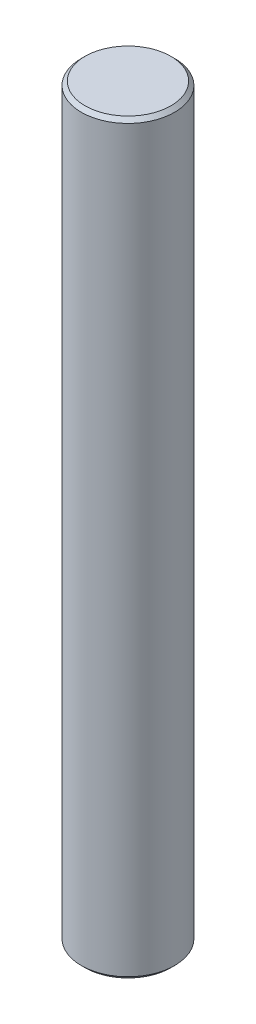
ISO-10303-21;
HEADER;
FILE_DESCRIPTION(('STEP AP214'),'2;1');
FILE_NAME('part.step','',(''),(''),'','','');
FILE_SCHEMA(('AUTOMOTIVE_DESIGN { 1 0 10303 214 1 1 1 1 }'));
ENDSEC;
DATA;
#1=APPLICATION_CONTEXT('core data for automotive mechanical design processes');
#2=APPLICATION_PROTOCOL_DEFINITION('international standard','automotive_design',2000,#1);
#3=PRODUCT_CONTEXT('',#1,'mechanical');
#4=PRODUCT('Part','Part','',(#3));
#5=PRODUCT_RELATED_PRODUCT_CATEGORY('part','',(#4));
#6=PRODUCT_DEFINITION_FORMATION('','',#4);
#7=PRODUCT_DEFINITION_CONTEXT('part definition',#1,'design');
#8=PRODUCT_DEFINITION('design','',#6,#7);
#9=PRODUCT_DEFINITION_SHAPE('','',#8);
#10=(LENGTH_UNIT() NAMED_UNIT(*) SI_UNIT(.MILLI.,.METRE.));
#11=(NAMED_UNIT(*) PLANE_ANGLE_UNIT() SI_UNIT($,.RADIAN.));
#12=(NAMED_UNIT(*) SI_UNIT($,.STERADIAN.) SOLID_ANGLE_UNIT());
#13=UNCERTAINTY_MEASURE_WITH_UNIT(LENGTH_MEASURE(1.E-05),#10,'distance_accuracy_value','');
#14=(GEOMETRIC_REPRESENTATION_CONTEXT(3) GLOBAL_UNCERTAINTY_ASSIGNED_CONTEXT((#13)) GLOBAL_UNIT_ASSIGNED_CONTEXT((#10,
#11,#12)) REPRESENTATION_CONTEXT('',''));
#15=CARTESIAN_POINT('',(0.,0.,0.));
#16=DIRECTION('',(0.,0.,1.));
#17=DIRECTION('',(1.,0.,0.));
#18=AXIS2_PLACEMENT_3D('',#15,#16,#17);
#19=CARTESIAN_POINT('',(0.,200.,0.));
#20=DIRECTION('',(0.,-1.,0.));
#21=DIRECTION('',(0.,0.,-1.));
#22=AXIS2_PLACEMENT_3D('',#19,#20,#21);
#23=CYLINDRICAL_SURFACE('',#22,12.5);
#24=CARTESIAN_POINT('',(0.,0.999999999999973,0.));
#25=DIRECTION('',(0.,1.,0.));
#26=DIRECTION('',(0.,0.,1.));
#27=AXIS2_PLACEMENT_3D('',#24,#25,#26);
#28=CIRCLE('',#27,12.5);
#29=CARTESIAN_POINT('',(0.,0.999999999999973,12.5));
#30=VERTEX_POINT('',#29);
#31=EDGE_CURVE('E49',#30,#30,#28,.T.);
#32=ORIENTED_EDGE('',*,*,#31,.T.);
#33=EDGE_LOOP('',(#32));
#34=FACE_BOUND('',#33,.T.);
#35=CARTESIAN_POINT('',(0.,199.,0.));
#36=DIRECTION('',(0.,1.,0.));
#37=DIRECTION('',(0.,0.,1.));
#38=AXIS2_PLACEMENT_3D('',#35,#36,#37);
#39=CIRCLE('',#38,12.5);
#40=CARTESIAN_POINT('',(0.,199.,12.5));
#41=VERTEX_POINT('',#40);
#42=EDGE_CURVE('E53',#41,#41,#39,.F.);
#43=ORIENTED_EDGE('',*,*,#42,.T.);
#44=EDGE_LOOP('',(#43));
#45=FACE_BOUND('',#44,.T.);
#46=ADVANCED_FACE('F37',(#34,#45),#23,.T.);
#47=CARTESIAN_POINT('',(0.,200.,0.));
#48=DIRECTION('',(0.,1.,0.));
#49=DIRECTION('',(0.,0.,1.));
#50=AXIS2_PLACEMENT_3D('',#47,#48,#49);
#51=PLANE('',#50);
#52=CARTESIAN_POINT('',(0.,200.,0.));
#53=DIRECTION('',(0.,1.,0.));
#54=DIRECTION('',(0.,0.,1.));
#55=AXIS2_PLACEMENT_3D('',#52,#53,#54);
#56=CIRCLE('',#55,11.5);
#57=CARTESIAN_POINT('',(0.,200.,11.5));
#58=VERTEX_POINT('',#57);
#59=EDGE_CURVE('E10',#58,#58,#56,.T.);
#60=ORIENTED_EDGE('',*,*,#59,.T.);
#61=EDGE_LOOP('',(#60));
#62=FACE_BOUND('',#61,.T.);
#63=ADVANCED_FACE('F69',(#62),#51,.T.);
#64=CARTESIAN_POINT('',(0.,0.,0.));
#65=DIRECTION('',(0.,1.,0.));
#66=DIRECTION('',(0.,0.,1.));
#67=AXIS2_PLACEMENT_3D('',#64,#65,#66);
#68=PLANE('',#67);
#69=CARTESIAN_POINT('',(0.,0.,0.));
#70=DIRECTION('',(0.,1.,0.));
#71=DIRECTION('',(0.,0.,1.));
#72=AXIS2_PLACEMENT_3D('',#69,#70,#71);
#73=CIRCLE('',#72,11.5);
#74=CARTESIAN_POINT('',(0.,0.,11.5));
#75=VERTEX_POINT('',#74);
#76=EDGE_CURVE('E45',#75,#75,#73,.F.);
#77=ORIENTED_EDGE('',*,*,#76,.T.);
#78=EDGE_LOOP('',(#77));
#79=FACE_BOUND('',#78,.T.);
#80=ADVANCED_FACE('F66',(#79),#68,.F.);
#81=CARTESIAN_POINT('',(0.,0.999999999999973,0.));
#82=DIRECTION('',(0.,1.,0.));
#83=DIRECTION('',(0.,0.,1.));
#84=AXIS2_PLACEMENT_3D('',#81,#82,#83);
#85=CONICAL_SURFACE('',#84,12.5,0.785398163397457);
#86=ORIENTED_EDGE('',*,*,#76,.F.);
#87=EDGE_LOOP('',(#86));
#88=FACE_BOUND('',#87,.T.);
#89=ORIENTED_EDGE('',*,*,#31,.F.);
#90=EDGE_LOOP('',(#89));
#91=FACE_BOUND('',#90,.T.);
#92=ADVANCED_FACE('F62',(#88,#91),#85,.T.);
#93=CARTESIAN_POINT('',(0.,200.,0.));
#94=DIRECTION('',(0.,-1.,0.));
#95=DIRECTION('',(0.,0.,-1.));
#96=AXIS2_PLACEMENT_3D('',#93,#94,#95);
#97=CONICAL_SURFACE('',#96,11.5,0.785398163397457);
#98=ORIENTED_EDGE('',*,*,#42,.F.);
#99=EDGE_LOOP('',(#98));
#100=FACE_BOUND('',#99,.T.);
#101=ORIENTED_EDGE('',*,*,#59,.F.);
#102=EDGE_LOOP('',(#101));
#103=FACE_BOUND('',#102,.T.);
#104=ADVANCED_FACE('F40',(#100,#103),#97,.T.);
#105=CLOSED_SHELL('',(#46,#63,#80,#92,#104));
#106=MANIFOLD_SOLID_BREP('B2',#105);
#107=ADVANCED_BREP_SHAPE_REPRESENTATION('',(#18,#106),#14);
#108=SHAPE_DEFINITION_REPRESENTATION(#9,#107);
ENDSEC;
END-ISO-10303-21;
